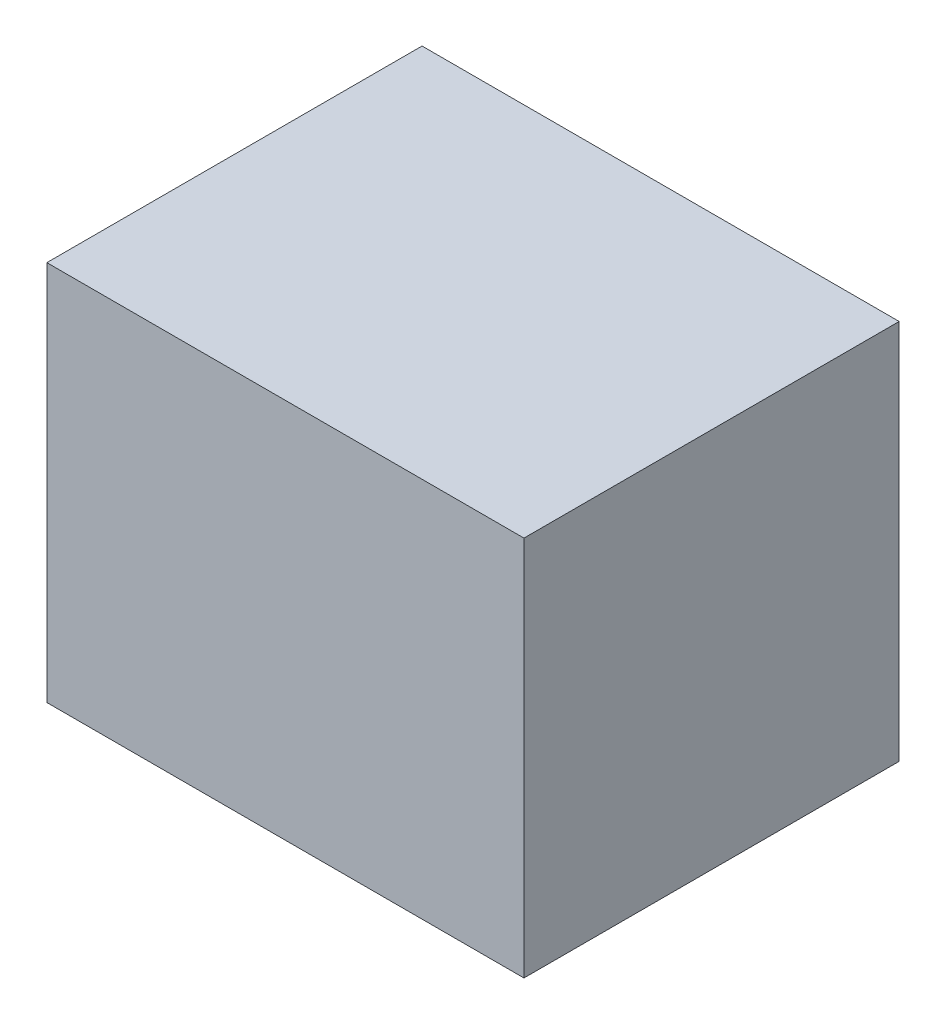
ISO-10303-21;
HEADER;
FILE_DESCRIPTION(('STEP AP214'),'2;1');
FILE_NAME('part.step','',(''),(''),'','','');
FILE_SCHEMA(('AUTOMOTIVE_DESIGN { 1 0 10303 214 1 1 1 1 }'));
ENDSEC;
DATA;
#1=APPLICATION_CONTEXT('core data for automotive mechanical design processes');
#2=APPLICATION_PROTOCOL_DEFINITION('international standard','automotive_design',2000,#1);
#3=PRODUCT_CONTEXT('',#1,'mechanical');
#4=PRODUCT('Part','Part','',(#3));
#5=PRODUCT_RELATED_PRODUCT_CATEGORY('part','',(#4));
#6=PRODUCT_DEFINITION_FORMATION('','',#4);
#7=PRODUCT_DEFINITION_CONTEXT('part definition',#1,'design');
#8=PRODUCT_DEFINITION('design','',#6,#7);
#9=PRODUCT_DEFINITION_SHAPE('','',#8);
#10=(LENGTH_UNIT() NAMED_UNIT(*) SI_UNIT(.MILLI.,.METRE.));
#11=(NAMED_UNIT(*) PLANE_ANGLE_UNIT() SI_UNIT($,.RADIAN.));
#12=(NAMED_UNIT(*) SI_UNIT($,.STERADIAN.) SOLID_ANGLE_UNIT());
#13=UNCERTAINTY_MEASURE_WITH_UNIT(LENGTH_MEASURE(1.E-05),#10,'distance_accuracy_value','');
#14=(GEOMETRIC_REPRESENTATION_CONTEXT(3) GLOBAL_UNCERTAINTY_ASSIGNED_CONTEXT((#13)) GLOBAL_UNIT_ASSIGNED_CONTEXT((#10,
#11,#12)) REPRESENTATION_CONTEXT('',''));
#15=CARTESIAN_POINT('',(0.,0.,0.));
#16=DIRECTION('',(0.,0.,1.));
#17=DIRECTION('',(1.,0.,0.));
#18=AXIS2_PLACEMENT_3D('',#15,#16,#17);
#19=CARTESIAN_POINT('',(0.,0.,0.));
#20=DIRECTION('',(1.,0.,0.));
#21=DIRECTION('',(0.,0.,1.));
#22=AXIS2_PLACEMENT_3D('',#19,#20,#21);
#23=PLANE('',#22);
#24=DIRECTION('',(0.,1.,0.));
#25=VECTOR('',#24,1.);
#26=CARTESIAN_POINT('',(0.,0.,0.637));
#27=LINE('',#26,#25);
#28=CARTESIAN_POINT('',(0.,0.,0.637));
#29=VERTEX_POINT('',#28);
#30=CARTESIAN_POINT('',(0.,0.6468,0.637));
#31=VERTEX_POINT('',#30);
#32=EDGE_CURVE('E11',#29,#31,#27,.T.);
#33=ORIENTED_EDGE('',*,*,#32,.T.);
#34=DIRECTION('',(0.,0.,1.));
#35=VECTOR('',#34,1.);
#36=CARTESIAN_POINT('',(0.,0.6468,0.));
#37=LINE('',#36,#35);
#38=CARTESIAN_POINT('',(0.,0.6468,0.));
#39=VERTEX_POINT('',#38);
#40=EDGE_CURVE('E24',#39,#31,#37,.T.);
#41=ORIENTED_EDGE('',*,*,#40,.F.);
#42=DIRECTION('',(0.,1.,0.));
#43=VECTOR('',#42,1.);
#44=CARTESIAN_POINT('',(0.,0.,0.));
#45=LINE('',#44,#43);
#46=CARTESIAN_POINT('',(0.,0.,0.));
#47=VERTEX_POINT('',#46);
#48=EDGE_CURVE('E86',#47,#39,#45,.T.);
#49=ORIENTED_EDGE('',*,*,#48,.F.);
#50=DIRECTION('',(0.,0.,1.));
#51=VECTOR('',#50,1.);
#52=CARTESIAN_POINT('',(0.,0.,0.));
#53=LINE('',#52,#51);
#54=EDGE_CURVE('E36',#47,#29,#53,.T.);
#55=ORIENTED_EDGE('',*,*,#54,.T.);
#56=EDGE_LOOP('',(#33,#41,#49,#55));
#57=FACE_BOUND('',#56,.T.);
#58=ADVANCED_FACE('F17',(#57),#23,.F.);
#59=CARTESIAN_POINT('',(0.81,0.,0.));
#60=DIRECTION('',(1.,0.,0.));
#61=DIRECTION('',(0.,0.,1.));
#62=AXIS2_PLACEMENT_3D('',#59,#60,#61);
#63=PLANE('',#62);
#64=DIRECTION('',(0.,0.,1.));
#65=VECTOR('',#64,1.);
#66=CARTESIAN_POINT('',(0.81,0.,0.));
#67=LINE('',#66,#65);
#68=CARTESIAN_POINT('',(0.81,0.,0.));
#69=VERTEX_POINT('',#68);
#70=CARTESIAN_POINT('',(0.81,0.,0.637));
#71=VERTEX_POINT('',#70);
#72=EDGE_CURVE('E83',#69,#71,#67,.T.);
#73=ORIENTED_EDGE('',*,*,#72,.F.);
#74=DIRECTION('',(0.,1.,0.));
#75=VECTOR('',#74,1.);
#76=CARTESIAN_POINT('',(0.81,0.,0.));
#77=LINE('',#76,#75);
#78=CARTESIAN_POINT('',(0.81,0.6468,0.));
#79=VERTEX_POINT('',#78);
#80=EDGE_CURVE('E63',#69,#79,#77,.T.);
#81=ORIENTED_EDGE('',*,*,#80,.T.);
#82=DIRECTION('',(0.,0.,1.));
#83=VECTOR('',#82,1.);
#84=CARTESIAN_POINT('',(0.81,0.6468,0.));
#85=LINE('',#84,#83);
#86=CARTESIAN_POINT('',(0.81,0.6468,0.637));
#87=VERTEX_POINT('',#86);
#88=EDGE_CURVE('E57',#79,#87,#85,.T.);
#89=ORIENTED_EDGE('',*,*,#88,.T.);
#90=DIRECTION('',(0.,1.,0.));
#91=VECTOR('',#90,1.);
#92=CARTESIAN_POINT('',(0.81,0.,0.637));
#93=LINE('',#92,#91);
#94=EDGE_CURVE('E60',#71,#87,#93,.T.);
#95=ORIENTED_EDGE('',*,*,#94,.F.);
#96=EDGE_LOOP('',(#73,#81,#89,#95));
#97=FACE_BOUND('',#96,.T.);
#98=ADVANCED_FACE('F59',(#97),#63,.T.);
#99=CARTESIAN_POINT('',(0.,0.,0.));
#100=DIRECTION('',(0.,1.,0.));
#101=DIRECTION('',(0.,0.,1.));
#102=AXIS2_PLACEMENT_3D('',#99,#100,#101);
#103=PLANE('',#102);
#104=ORIENTED_EDGE('',*,*,#72,.T.);
#105=DIRECTION('',(1.,0.,0.));
#106=VECTOR('',#105,1.);
#107=CARTESIAN_POINT('',(0.,0.,0.637));
#108=LINE('',#107,#106);
#109=EDGE_CURVE('E71',#29,#71,#108,.T.);
#110=ORIENTED_EDGE('',*,*,#109,.F.);
#111=ORIENTED_EDGE('',*,*,#54,.F.);
#112=DIRECTION('',(1.,0.,0.));
#113=VECTOR('',#112,1.);
#114=CARTESIAN_POINT('',(0.,0.,0.));
#115=LINE('',#114,#113);
#116=EDGE_CURVE('E76',#47,#69,#115,.T.);
#117=ORIENTED_EDGE('',*,*,#116,.T.);
#118=EDGE_LOOP('',(#104,#110,#111,#117));
#119=FACE_BOUND('',#118,.T.);
#120=ADVANCED_FACE('F91',(#119),#103,.F.);
#121=CARTESIAN_POINT('',(0.,0.6468,0.));
#122=DIRECTION('',(0.,1.,0.));
#123=DIRECTION('',(0.,0.,1.));
#124=AXIS2_PLACEMENT_3D('',#121,#122,#123);
#125=PLANE('',#124);
#126=DIRECTION('',(1.,0.,0.));
#127=VECTOR('',#126,1.);
#128=CARTESIAN_POINT('',(0.,0.6468,0.));
#129=LINE('',#128,#127);
#130=EDGE_CURVE('E74',#39,#79,#129,.T.);
#131=ORIENTED_EDGE('',*,*,#130,.F.);
#132=ORIENTED_EDGE('',*,*,#40,.T.);
#133=DIRECTION('',(1.,0.,0.));
#134=VECTOR('',#133,1.);
#135=CARTESIAN_POINT('',(0.,0.6468,0.637));
#136=LINE('',#135,#134);
#137=EDGE_CURVE('E69',#31,#87,#136,.T.);
#138=ORIENTED_EDGE('',*,*,#137,.T.);
#139=ORIENTED_EDGE('',*,*,#88,.F.);
#140=EDGE_LOOP('',(#131,#132,#138,#139));
#141=FACE_BOUND('',#140,.T.);
#142=ADVANCED_FACE('F73',(#141),#125,.T.);
#143=CARTESIAN_POINT('',(0.,0.,0.));
#144=DIRECTION('',(0.,0.,1.));
#145=DIRECTION('',(1.,0.,0.));
#146=AXIS2_PLACEMENT_3D('',#143,#144,#145);
#147=PLANE('',#146);
#148=ORIENTED_EDGE('',*,*,#130,.T.);
#149=ORIENTED_EDGE('',*,*,#80,.F.);
#150=ORIENTED_EDGE('',*,*,#116,.F.);
#151=ORIENTED_EDGE('',*,*,#48,.T.);
#152=EDGE_LOOP('',(#148,#149,#150,#151));
#153=FACE_BOUND('',#152,.T.);
#154=ADVANCED_FACE('F89',(#153),#147,.F.);
#155=CARTESIAN_POINT('',(0.,0.,0.637));
#156=DIRECTION('',(0.,0.,1.));
#157=DIRECTION('',(1.,0.,0.));
#158=AXIS2_PLACEMENT_3D('',#155,#156,#157);
#159=PLANE('',#158);
#160=ORIENTED_EDGE('',*,*,#32,.F.);
#161=ORIENTED_EDGE('',*,*,#109,.T.);
#162=ORIENTED_EDGE('',*,*,#94,.T.);
#163=ORIENTED_EDGE('',*,*,#137,.F.);
#164=EDGE_LOOP('',(#160,#161,#162,#163));
#165=FACE_BOUND('',#164,.T.);
#166=ADVANCED_FACE('F68',(#165),#159,.T.);
#167=CLOSED_SHELL('',(#58,#98,#120,#142,#154,#166));
#168=MANIFOLD_SOLID_BREP('B1',#167);
#169=ADVANCED_BREP_SHAPE_REPRESENTATION('',(#18,#168),#14);
#170=SHAPE_DEFINITION_REPRESENTATION(#9,#169);
ENDSEC;
END-ISO-10303-21;
